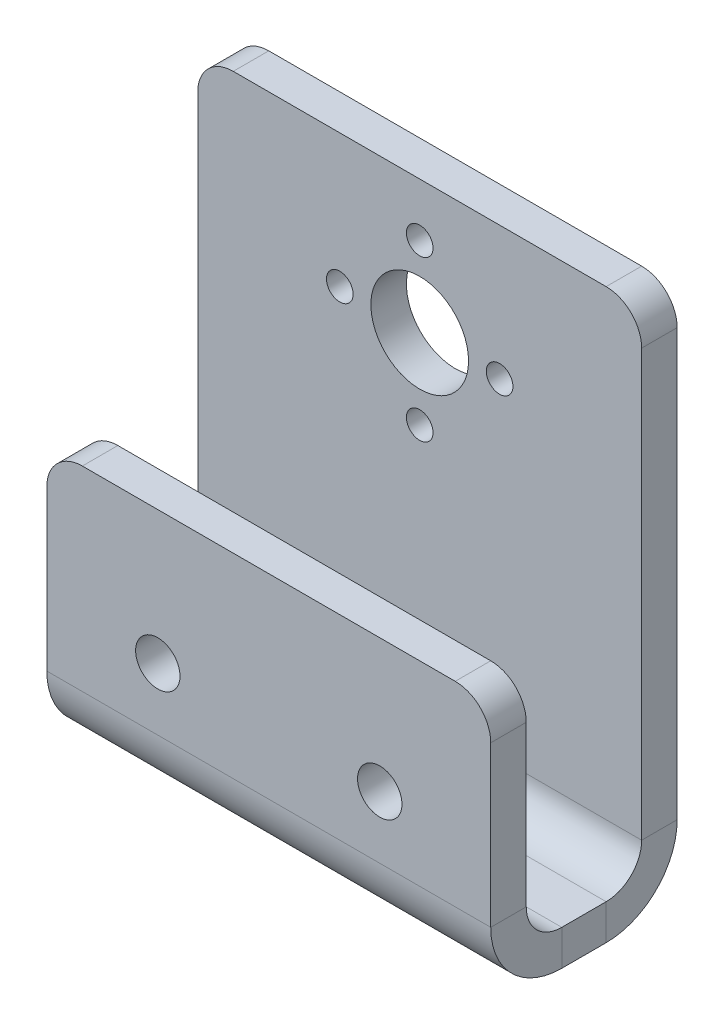
ISO-10303-21;
HEADER;
FILE_DESCRIPTION(('STEP AP214'),'2;1');
FILE_NAME('part.step','',(''),(''),'','','');
FILE_SCHEMA(('AUTOMOTIVE_DESIGN { 1 0 10303 214 1 1 1 1 }'));
ENDSEC;
DATA;
#1=APPLICATION_CONTEXT('core data for automotive mechanical design processes');
#2=APPLICATION_PROTOCOL_DEFINITION('international standard','automotive_design',2000,#1);
#3=PRODUCT_CONTEXT('',#1,'mechanical');
#4=PRODUCT('Part','Part','',(#3));
#5=PRODUCT_RELATED_PRODUCT_CATEGORY('part','',(#4));
#6=PRODUCT_DEFINITION_FORMATION('','',#4);
#7=PRODUCT_DEFINITION_CONTEXT('part definition',#1,'design');
#8=PRODUCT_DEFINITION('design','',#6,#7);
#9=PRODUCT_DEFINITION_SHAPE('','',#8);
#10=(LENGTH_UNIT() NAMED_UNIT(*) SI_UNIT(.MILLI.,.METRE.));
#11=(NAMED_UNIT(*) PLANE_ANGLE_UNIT() SI_UNIT($,.RADIAN.));
#12=(NAMED_UNIT(*) SI_UNIT($,.STERADIAN.) SOLID_ANGLE_UNIT());
#13=UNCERTAINTY_MEASURE_WITH_UNIT(LENGTH_MEASURE(1.E-05),#10,'distance_accuracy_value','');
#14=(GEOMETRIC_REPRESENTATION_CONTEXT(3) GLOBAL_UNCERTAINTY_ASSIGNED_CONTEXT((#13)) GLOBAL_UNIT_ASSIGNED_CONTEXT((#10,
#11,#12)) REPRESENTATION_CONTEXT('',''));
#15=CARTESIAN_POINT('',(0.,0.,0.));
#16=DIRECTION('',(0.,0.,1.));
#17=DIRECTION('',(1.,0.,0.));
#18=AXIS2_PLACEMENT_3D('',#15,#16,#17);
#19=CARTESIAN_POINT('',(50.,-56.,17.));
#20=DIRECTION('',(1.,0.,0.));
#21=DIRECTION('',(0.,0.,-1.));
#22=AXIS2_PLACEMENT_3D('',#19,#20,#21);
#23=PLANE('',#22);
#24=DIRECTION('',(0.,1.,0.));
#25=VECTOR('',#24,1.);
#26=CARTESIAN_POINT('',(50.,-56.,13.));
#27=LINE('',#26,#25);
#28=CARTESIAN_POINT('',(50.,-60.,13.));
#29=VERTEX_POINT('',#28);
#30=CARTESIAN_POINT('',(50.,-56.,13.));
#31=VERTEX_POINT('',#30);
#32=EDGE_CURVE('E281',#29,#31,#27,.T.);
#33=ORIENTED_EDGE('',*,*,#32,.F.);
#34=DIRECTION('',(0.,0.,1.));
#35=VECTOR('',#34,1.);
#36=CARTESIAN_POINT('',(50.,-60.,17.));
#37=LINE('',#36,#35);
#38=CARTESIAN_POINT('',(50.,-60.,7.99999999999999));
#39=VERTEX_POINT('',#38);
#40=EDGE_CURVE('E242',#29,#39,#37,.F.);
#41=ORIENTED_EDGE('',*,*,#40,.T.);
#42=DIRECTION('',(0.,1.,0.));
#43=VECTOR('',#42,1.);
#44=CARTESIAN_POINT('',(50.,-56.,7.99999999999999));
#45=LINE('',#44,#43);
#46=CARTESIAN_POINT('',(50.,-56.,7.99999999999999));
#47=VERTEX_POINT('',#46);
#48=EDGE_CURVE('E279',#39,#47,#45,.T.);
#49=ORIENTED_EDGE('',*,*,#48,.T.);
#50=DIRECTION('',(0.,0.,-1.));
#51=VECTOR('',#50,1.);
#52=CARTESIAN_POINT('',(50.,-56.,17.));
#53=LINE('',#52,#51);
#54=EDGE_CURVE('E185',#31,#47,#53,.T.);
#55=ORIENTED_EDGE('',*,*,#54,.F.);
#56=EDGE_LOOP('',(#33,#41,#49,#55));
#57=FACE_BOUND('',#56,.T.);
#58=ADVANCED_FACE('F37',(#57),#23,.T.);
#59=CARTESIAN_POINT('',(50.,-52.,7.99999999999999));
#60=DIRECTION('',(1.,0.,0.));
#61=DIRECTION('',(0.,0.,-1.));
#62=AXIS2_PLACEMENT_3D('',#59,#60,#61);
#63=PLANE('',#62);
#64=ORIENTED_EDGE('',*,*,#48,.F.);
#65=CARTESIAN_POINT('',(50.,-52.,7.99999999999999));
#66=DIRECTION('',(1.,0.,0.));
#67=DIRECTION('',(0.,0.,-1.));
#68=AXIS2_PLACEMENT_3D('',#65,#66,#67);
#69=CIRCLE('',#68,8.);
#70=CARTESIAN_POINT('',(50.,-52.,0.));
#71=VERTEX_POINT('',#70);
#72=EDGE_CURVE('E243',#39,#71,#69,.T.);
#73=ORIENTED_EDGE('',*,*,#72,.T.);
#74=DIRECTION('',(0.,0.,1.));
#75=VECTOR('',#74,1.);
#76=CARTESIAN_POINT('',(50.,-52.,3.99999999999999));
#77=LINE('',#76,#75);
#78=CARTESIAN_POINT('',(50.,-52.,3.99999999999999));
#79=VERTEX_POINT('',#78);
#80=EDGE_CURVE('E277',#71,#79,#77,.T.);
#81=ORIENTED_EDGE('',*,*,#80,.T.);
#82=CARTESIAN_POINT('',(50.,-52.,7.99999999999999));
#83=DIRECTION('',(-1.,0.,0.));
#84=DIRECTION('',(0.,0.,1.));
#85=AXIS2_PLACEMENT_3D('',#82,#83,#84);
#86=CIRCLE('',#85,4.);
#87=EDGE_CURVE('E176',#47,#79,#86,.F.);
#88=ORIENTED_EDGE('',*,*,#87,.F.);
#89=EDGE_LOOP('',(#64,#73,#81,#88));
#90=FACE_BOUND('',#89,.T.);
#91=ADVANCED_FACE('F441',(#90),#63,.T.);
#92=CARTESIAN_POINT('',(50.,-56.,3.99999999999999));
#93=DIRECTION('',(1.,0.,0.));
#94=DIRECTION('',(0.,1.,0.));
#95=AXIS2_PLACEMENT_3D('',#92,#93,#94);
#96=PLANE('',#95);
#97=DIRECTION('',(0.,-1.,0.));
#98=VECTOR('',#97,1.);
#99=CARTESIAN_POINT('',(50.,-56.,0.));
#100=LINE('',#99,#98);
#101=CARTESIAN_POINT('',(50.,-4.,0.));
#102=VERTEX_POINT('',#101);
#103=EDGE_CURVE('E247',#71,#102,#100,.F.);
#104=ORIENTED_EDGE('',*,*,#103,.T.);
#105=DIRECTION('',(0.,0.,1.));
#106=VECTOR('',#105,1.);
#107=CARTESIAN_POINT('',(50.,-4.,3.99999999999999));
#108=LINE('',#107,#106);
#109=CARTESIAN_POINT('',(50.,-4.,3.99999999999999));
#110=VERTEX_POINT('',#109);
#111=EDGE_CURVE('E11',#102,#110,#108,.T.);
#112=ORIENTED_EDGE('',*,*,#111,.T.);
#113=DIRECTION('',(0.,1.,0.));
#114=VECTOR('',#113,1.);
#115=CARTESIAN_POINT('',(50.,-56.,3.99999999999999));
#116=LINE('',#115,#114);
#117=EDGE_CURVE('E330',#79,#110,#116,.T.);
#118=ORIENTED_EDGE('',*,*,#117,.F.);
#119=ORIENTED_EDGE('',*,*,#80,.F.);
#120=EDGE_LOOP('',(#104,#112,#118,#119));
#121=FACE_BOUND('',#120,.T.);
#122=ADVANCED_FACE('F447',(#121),#96,.T.);
#123=CARTESIAN_POINT('',(50.,0.,3.99999999999999));
#124=DIRECTION('',(0.,1.,0.));
#125=DIRECTION('',(-1.,0.,0.));
#126=AXIS2_PLACEMENT_3D('',#123,#124,#125);
#127=PLANE('',#126);
#128=DIRECTION('',(1.,0.,0.));
#129=VECTOR('',#128,1.);
#130=CARTESIAN_POINT('',(50.,0.,0.));
#131=LINE('',#130,#129);
#132=CARTESIAN_POINT('',(46.,0.,0.));
#133=VERTEX_POINT('',#132);
#134=CARTESIAN_POINT('',(4.,0.,0.));
#135=VERTEX_POINT('',#134);
#136=EDGE_CURVE('E226',#133,#135,#131,.F.);
#137=ORIENTED_EDGE('',*,*,#136,.T.);
#138=DIRECTION('',(0.,0.,-1.));
#139=VECTOR('',#138,1.);
#140=CARTESIAN_POINT('',(4.,0.,3.99999999999999));
#141=LINE('',#140,#139);
#142=CARTESIAN_POINT('',(4.,0.,3.99999999999999));
#143=VERTEX_POINT('',#142);
#144=EDGE_CURVE('E305',#135,#143,#141,.F.);
#145=ORIENTED_EDGE('',*,*,#144,.T.);
#146=DIRECTION('',(-1.,0.,0.));
#147=VECTOR('',#146,1.);
#148=CARTESIAN_POINT('',(50.,0.,3.99999999999999));
#149=LINE('',#148,#147);
#150=CARTESIAN_POINT('',(46.,0.,3.99999999999999));
#151=VERTEX_POINT('',#150);
#152=EDGE_CURVE('E328',#151,#143,#149,.T.);
#153=ORIENTED_EDGE('',*,*,#152,.F.);
#154=DIRECTION('',(0.,0.,1.));
#155=VECTOR('',#154,1.);
#156=CARTESIAN_POINT('',(46.,0.,3.99999999999999));
#157=LINE('',#156,#155);
#158=EDGE_CURVE('E303',#151,#133,#157,.F.);
#159=ORIENTED_EDGE('',*,*,#158,.T.);
#160=EDGE_LOOP('',(#137,#145,#153,#159));
#161=FACE_BOUND('',#160,.T.);
#162=ADVANCED_FACE('F319',(#161),#127,.T.);
#163=CARTESIAN_POINT('',(0.,-56.,3.99999999999999));
#164=DIRECTION('',(1.,0.,0.));
#165=DIRECTION('',(0.,1.,0.));
#166=AXIS2_PLACEMENT_3D('',#163,#164,#165);
#167=PLANE('',#166);
#168=DIRECTION('',(0.,1.,0.));
#169=VECTOR('',#168,1.);
#170=CARTESIAN_POINT('',(0.,-56.,3.99999999999999));
#171=LINE('',#170,#169);
#172=CARTESIAN_POINT('',(0.,-52.,3.99999999999999));
#173=VERTEX_POINT('',#172);
#174=CARTESIAN_POINT('',(0.,-4.,3.99999999999999));
#175=VERTEX_POINT('',#174);
#176=EDGE_CURVE('E327',#173,#175,#171,.T.);
#177=ORIENTED_EDGE('',*,*,#176,.T.);
#178=DIRECTION('',(0.,0.,1.));
#179=VECTOR('',#178,1.);
#180=CARTESIAN_POINT('',(0.,-4.,3.99999999999999));
#181=LINE('',#180,#179);
#182=CARTESIAN_POINT('',(0.,-4.,0.));
#183=VERTEX_POINT('',#182);
#184=EDGE_CURVE('E60',#175,#183,#181,.F.);
#185=ORIENTED_EDGE('',*,*,#184,.T.);
#186=DIRECTION('',(0.,-1.,0.));
#187=VECTOR('',#186,1.);
#188=CARTESIAN_POINT('',(0.,-56.,0.));
#189=LINE('',#188,#187);
#190=CARTESIAN_POINT('',(0.,-52.,0.));
#191=VERTEX_POINT('',#190);
#192=EDGE_CURVE('E245',#191,#183,#189,.F.);
#193=ORIENTED_EDGE('',*,*,#192,.F.);
#194=DIRECTION('',(0.,0.,1.));
#195=VECTOR('',#194,1.);
#196=CARTESIAN_POINT('',(0.,-52.,3.99999999999999));
#197=LINE('',#196,#195);
#198=EDGE_CURVE('E165',#191,#173,#197,.T.);
#199=ORIENTED_EDGE('',*,*,#198,.T.);
#200=EDGE_LOOP('',(#177,#185,#193,#199));
#201=FACE_BOUND('',#200,.T.);
#202=ADVANCED_FACE('F329',(#201),#167,.F.);
#203=CARTESIAN_POINT('',(0.,-52.,7.99999999999999));
#204=DIRECTION('',(-1.,0.,0.));
#205=DIRECTION('',(0.,0.,1.));
#206=AXIS2_PLACEMENT_3D('',#203,#204,#205);
#207=PLANE('',#206);
#208=ORIENTED_EDGE('',*,*,#198,.F.);
#209=CARTESIAN_POINT('',(0.,-52.,7.99999999999999));
#210=DIRECTION('',(1.,0.,0.));
#211=DIRECTION('',(0.,0.,-1.));
#212=AXIS2_PLACEMENT_3D('',#209,#210,#211);
#213=CIRCLE('',#212,8.);
#214=CARTESIAN_POINT('',(0.,-60.,7.99999999999999));
#215=VERTEX_POINT('',#214);
#216=EDGE_CURVE('E160',#191,#215,#213,.F.);
#217=ORIENTED_EDGE('',*,*,#216,.T.);
#218=DIRECTION('',(0.,1.,0.));
#219=VECTOR('',#218,1.);
#220=CARTESIAN_POINT('',(0.,-56.,7.99999999999999));
#221=LINE('',#220,#219);
#222=CARTESIAN_POINT('',(0.,-56.,7.99999999999999));
#223=VERTEX_POINT('',#222);
#224=EDGE_CURVE('E154',#215,#223,#221,.T.);
#225=ORIENTED_EDGE('',*,*,#224,.T.);
#226=CARTESIAN_POINT('',(0.,-52.,7.99999999999999));
#227=DIRECTION('',(1.,0.,0.));
#228=DIRECTION('',(0.,0.,-1.));
#229=AXIS2_PLACEMENT_3D('',#226,#227,#228);
#230=CIRCLE('',#229,4.);
#231=EDGE_CURVE('E157',#173,#223,#230,.F.);
#232=ORIENTED_EDGE('',*,*,#231,.F.);
#233=EDGE_LOOP('',(#208,#217,#225,#232));
#234=FACE_BOUND('',#233,.T.);
#235=ADVANCED_FACE('F156',(#234),#207,.T.);
#236=CARTESIAN_POINT('',(0.,-56.,17.));
#237=DIRECTION('',(1.,0.,0.));
#238=DIRECTION('',(0.,0.,-1.));
#239=AXIS2_PLACEMENT_3D('',#236,#237,#238);
#240=PLANE('',#239);
#241=ORIENTED_EDGE('',*,*,#224,.F.);
#242=DIRECTION('',(0.,0.,1.));
#243=VECTOR('',#242,1.);
#244=CARTESIAN_POINT('',(0.,-60.,17.));
#245=LINE('',#244,#243);
#246=CARTESIAN_POINT('',(0.,-60.,13.));
#247=VERTEX_POINT('',#246);
#248=EDGE_CURVE('E239',#247,#215,#245,.F.);
#249=ORIENTED_EDGE('',*,*,#248,.F.);
#250=DIRECTION('',(0.,1.,0.));
#251=VECTOR('',#250,1.);
#252=CARTESIAN_POINT('',(0.,-56.,13.));
#253=LINE('',#252,#251);
#254=CARTESIAN_POINT('',(0.,-56.,13.));
#255=VERTEX_POINT('',#254);
#256=EDGE_CURVE('E166',#247,#255,#253,.T.);
#257=ORIENTED_EDGE('',*,*,#256,.T.);
#258=DIRECTION('',(0.,0.,-1.));
#259=VECTOR('',#258,1.);
#260=CARTESIAN_POINT('',(0.,-56.,17.));
#261=LINE('',#260,#259);
#262=EDGE_CURVE('E180',#255,#223,#261,.T.);
#263=ORIENTED_EDGE('',*,*,#262,.T.);
#264=EDGE_LOOP('',(#241,#249,#257,#263));
#265=FACE_BOUND('',#264,.T.);
#266=ADVANCED_FACE('F181',(#265),#240,.F.);
#267=CARTESIAN_POINT('',(0.,-52.,13.));
#268=DIRECTION('',(-1.,0.,0.));
#269=DIRECTION('',(0.,0.,1.));
#270=AXIS2_PLACEMENT_3D('',#267,#268,#269);
#271=PLANE('',#270);
#272=ORIENTED_EDGE('',*,*,#256,.F.);
#273=CARTESIAN_POINT('',(0.,-52.,13.));
#274=DIRECTION('',(1.,0.,0.));
#275=DIRECTION('',(0.,0.,-1.));
#276=AXIS2_PLACEMENT_3D('',#273,#274,#275);
#277=CIRCLE('',#276,8.);
#278=CARTESIAN_POINT('',(0.,-52.,21.));
#279=VERTEX_POINT('',#278);
#280=EDGE_CURVE('E235',#247,#279,#277,.F.);
#281=ORIENTED_EDGE('',*,*,#280,.T.);
#282=DIRECTION('',(0.,0.,-1.));
#283=VECTOR('',#282,1.);
#284=CARTESIAN_POINT('',(0.,-52.,17.));
#285=LINE('',#284,#283);
#286=CARTESIAN_POINT('',(0.,-52.,17.));
#287=VERTEX_POINT('',#286);
#288=EDGE_CURVE('E272',#279,#287,#285,.T.);
#289=ORIENTED_EDGE('',*,*,#288,.T.);
#290=CARTESIAN_POINT('',(0.,-52.,13.));
#291=DIRECTION('',(1.,0.,0.));
#292=DIRECTION('',(0.,0.,-1.));
#293=AXIS2_PLACEMENT_3D('',#290,#291,#292);
#294=CIRCLE('',#293,4.);
#295=EDGE_CURVE('E205',#255,#287,#294,.F.);
#296=ORIENTED_EDGE('',*,*,#295,.F.);
#297=EDGE_LOOP('',(#272,#281,#289,#296));
#298=FACE_BOUND('',#297,.T.);
#299=ADVANCED_FACE('F374',(#298),#271,.T.);
#300=CARTESIAN_POINT('',(0.,-30.,17.));
#301=DIRECTION('',(1.,0.,0.));
#302=DIRECTION('',(0.,-1.,0.));
#303=AXIS2_PLACEMENT_3D('',#300,#301,#302);
#304=PLANE('',#303);
#305=DIRECTION('',(0.,1.,0.));
#306=VECTOR('',#305,1.);
#307=CARTESIAN_POINT('',(0.,-30.,21.));
#308=LINE('',#307,#306);
#309=CARTESIAN_POINT('',(0.,-34.,21.));
#310=VERTEX_POINT('',#309);
#311=EDGE_CURVE('E229',#310,#279,#308,.F.);
#312=ORIENTED_EDGE('',*,*,#311,.F.);
#313=DIRECTION('',(0.,0.,1.));
#314=VECTOR('',#313,1.);
#315=CARTESIAN_POINT('',(0.,-34.,17.));
#316=LINE('',#315,#314);
#317=CARTESIAN_POINT('',(0.,-34.,17.));
#318=VERTEX_POINT('',#317);
#319=EDGE_CURVE('E300',#310,#318,#316,.F.);
#320=ORIENTED_EDGE('',*,*,#319,.T.);
#321=DIRECTION('',(0.,-1.,0.));
#322=VECTOR('',#321,1.);
#323=CARTESIAN_POINT('',(0.,-30.,17.));
#324=LINE('',#323,#322);
#325=EDGE_CURVE('E347',#318,#287,#324,.T.);
#326=ORIENTED_EDGE('',*,*,#325,.T.);
#327=ORIENTED_EDGE('',*,*,#288,.F.);
#328=EDGE_LOOP('',(#312,#320,#326,#327));
#329=FACE_BOUND('',#328,.T.);
#330=ADVANCED_FACE('F367',(#329),#304,.F.);
#331=CARTESIAN_POINT('',(50.,-30.,17.));
#332=DIRECTION('',(0.,-1.,0.));
#333=DIRECTION('',(-1.,0.,0.));
#334=AXIS2_PLACEMENT_3D('',#331,#332,#333);
#335=PLANE('',#334);
#336=DIRECTION('',(1.,0.,0.));
#337=VECTOR('',#336,1.);
#338=CARTESIAN_POINT('',(50.,-30.,21.));
#339=LINE('',#338,#337);
#340=CARTESIAN_POINT('',(46.,-30.,21.));
#341=VERTEX_POINT('',#340);
#342=CARTESIAN_POINT('',(4.,-30.,21.));
#343=VERTEX_POINT('',#342);
#344=EDGE_CURVE('E231',#341,#343,#339,.F.);
#345=ORIENTED_EDGE('',*,*,#344,.F.);
#346=DIRECTION('',(0.,0.,-1.));
#347=VECTOR('',#346,1.);
#348=CARTESIAN_POINT('',(46.,-30.,17.));
#349=LINE('',#348,#347);
#350=CARTESIAN_POINT('',(46.,-30.,17.));
#351=VERTEX_POINT('',#350);
#352=EDGE_CURVE('E287',#341,#351,#349,.T.);
#353=ORIENTED_EDGE('',*,*,#352,.T.);
#354=DIRECTION('',(-1.,0.,0.));
#355=VECTOR('',#354,1.);
#356=CARTESIAN_POINT('',(50.,-30.,17.));
#357=LINE('',#356,#355);
#358=CARTESIAN_POINT('',(4.,-30.,17.));
#359=VERTEX_POINT('',#358);
#360=EDGE_CURVE('E195',#351,#359,#357,.T.);
#361=ORIENTED_EDGE('',*,*,#360,.T.);
#362=DIRECTION('',(0.,0.,1.));
#363=VECTOR('',#362,1.);
#364=CARTESIAN_POINT('',(4.,-30.,17.));
#365=LINE('',#364,#363);
#366=EDGE_CURVE('E283',#359,#343,#365,.T.);
#367=ORIENTED_EDGE('',*,*,#366,.T.);
#368=EDGE_LOOP('',(#345,#353,#361,#367));
#369=FACE_BOUND('',#368,.T.);
#370=ADVANCED_FACE('F353',(#369),#335,.F.);
#371=CARTESIAN_POINT('',(50.,-30.,17.));
#372=DIRECTION('',(1.,0.,0.));
#373=DIRECTION('',(0.,-1.,0.));
#374=AXIS2_PLACEMENT_3D('',#371,#372,#373);
#375=PLANE('',#374);
#376=DIRECTION('',(0.,-1.,0.));
#377=VECTOR('',#376,1.);
#378=CARTESIAN_POINT('',(50.,-30.,17.));
#379=LINE('',#378,#377);
#380=CARTESIAN_POINT('',(50.,-34.,17.));
#381=VERTEX_POINT('',#380);
#382=CARTESIAN_POINT('',(50.,-52.,17.));
#383=VERTEX_POINT('',#382);
#384=EDGE_CURVE('E191',#381,#383,#379,.T.);
#385=ORIENTED_EDGE('',*,*,#384,.F.);
#386=DIRECTION('',(0.,0.,1.));
#387=VECTOR('',#386,1.);
#388=CARTESIAN_POINT('',(50.,-34.,17.));
#389=LINE('',#388,#387);
#390=CARTESIAN_POINT('',(50.,-34.,21.));
#391=VERTEX_POINT('',#390);
#392=EDGE_CURVE('E294',#381,#391,#389,.T.);
#393=ORIENTED_EDGE('',*,*,#392,.T.);
#394=DIRECTION('',(0.,1.,0.));
#395=VECTOR('',#394,1.);
#396=CARTESIAN_POINT('',(50.,-30.,21.));
#397=LINE('',#396,#395);
#398=CARTESIAN_POINT('',(50.,-52.,21.));
#399=VERTEX_POINT('',#398);
#400=EDGE_CURVE('E219',#391,#399,#397,.F.);
#401=ORIENTED_EDGE('',*,*,#400,.T.);
#402=DIRECTION('',(0.,0.,-1.));
#403=VECTOR('',#402,1.);
#404=CARTESIAN_POINT('',(50.,-52.,17.));
#405=LINE('',#404,#403);
#406=EDGE_CURVE('E204',#399,#383,#405,.T.);
#407=ORIENTED_EDGE('',*,*,#406,.T.);
#408=EDGE_LOOP('',(#385,#393,#401,#407));
#409=FACE_BOUND('',#408,.T.);
#410=ADVANCED_FACE('F390',(#409),#375,.T.);
#411=CARTESIAN_POINT('',(25.,-6.,3.99999999999999));
#412=DIRECTION('',(0.,0.,1.));
#413=DIRECTION('',(0.,-1.,0.));
#414=AXIS2_PLACEMENT_3D('',#411,#412,#413);
#415=CYLINDRICAL_SURFACE('',#414,1.5);
#416=CARTESIAN_POINT('',(25.,-6.,3.99999999999999));
#417=DIRECTION('',(0.,0.,1.));
#418=DIRECTION('',(1.,0.,0.));
#419=AXIS2_PLACEMENT_3D('',#416,#417,#418);
#420=CIRCLE('',#419,1.5);
#421=CARTESIAN_POINT('',(26.5,-6.,3.99999999999999));
#422=VERTEX_POINT('',#421);
#423=EDGE_CURVE('E398',#422,#422,#420,.T.);
#424=ORIENTED_EDGE('',*,*,#423,.T.);
#425=EDGE_LOOP('',(#424));
#426=FACE_BOUND('',#425,.T.);
#427=CARTESIAN_POINT('',(25.,-6.,0.));
#428=DIRECTION('',(0.,0.,1.));
#429=DIRECTION('',(1.,0.,0.));
#430=AXIS2_PLACEMENT_3D('',#427,#428,#429);
#431=CIRCLE('',#430,1.5);
#432=CARTESIAN_POINT('',(26.5,-6.,0.));
#433=VERTEX_POINT('',#432);
#434=EDGE_CURVE('E256',#433,#433,#431,.T.);
#435=ORIENTED_EDGE('',*,*,#434,.F.);
#436=EDGE_LOOP('',(#435));
#437=FACE_BOUND('',#436,.T.);
#438=ADVANCED_FACE('F455',(#426,#437),#415,.F.);
#439=CARTESIAN_POINT('',(16.0000000000003,-15.0000000000002,3.99999999999999));
#440=DIRECTION('',(0.,0.,1.));
#441=DIRECTION('',(0.,-1.,0.));
#442=AXIS2_PLACEMENT_3D('',#439,#440,#441);
#443=CYLINDRICAL_SURFACE('',#442,1.5);
#444=CARTESIAN_POINT('',(16.0000000000003,-15.0000000000002,3.99999999999999));
#445=DIRECTION('',(0.,0.,1.));
#446=DIRECTION('',(1.,0.,0.));
#447=AXIS2_PLACEMENT_3D('',#444,#445,#446);
#448=CIRCLE('',#447,1.5);
#449=CARTESIAN_POINT('',(17.5000000000003,-15.0000000000002,3.99999999999999));
#450=VERTEX_POINT('',#449);
#451=EDGE_CURVE('E401',#450,#450,#448,.T.);
#452=ORIENTED_EDGE('',*,*,#451,.T.);
#453=EDGE_LOOP('',(#452));
#454=FACE_BOUND('',#453,.T.);
#455=CARTESIAN_POINT('',(16.0000000000003,-15.0000000000002,0.));
#456=DIRECTION('',(0.,0.,1.));
#457=DIRECTION('',(1.,0.,0.));
#458=AXIS2_PLACEMENT_3D('',#455,#456,#457);
#459=CIRCLE('',#458,1.5);
#460=CARTESIAN_POINT('',(17.5000000000003,-15.0000000000002,0.));
#461=VERTEX_POINT('',#460);
#462=EDGE_CURVE('E261',#461,#461,#459,.T.);
#463=ORIENTED_EDGE('',*,*,#462,.F.);
#464=EDGE_LOOP('',(#463));
#465=FACE_BOUND('',#464,.T.);
#466=ADVANCED_FACE('F458',(#454,#465),#443,.F.);
#467=CARTESIAN_POINT('',(25.0000000000005,-24.,3.99999999999999));
#468=DIRECTION('',(0.,0.,1.));
#469=DIRECTION('',(0.,-1.,0.));
#470=AXIS2_PLACEMENT_3D('',#467,#468,#469);
#471=CYLINDRICAL_SURFACE('',#470,1.5);
#472=CARTESIAN_POINT('',(25.0000000000005,-24.,3.99999999999999));
#473=DIRECTION('',(0.,0.,1.));
#474=DIRECTION('',(1.,0.,0.));
#475=AXIS2_PLACEMENT_3D('',#472,#473,#474);
#476=CIRCLE('',#475,1.5);
#477=CARTESIAN_POINT('',(26.5000000000005,-24.,3.99999999999999));
#478=VERTEX_POINT('',#477);
#479=EDGE_CURVE('E406',#478,#478,#476,.T.);
#480=ORIENTED_EDGE('',*,*,#479,.T.);
#481=EDGE_LOOP('',(#480));
#482=FACE_BOUND('',#481,.T.);
#483=CARTESIAN_POINT('',(25.0000000000005,-24.,0.));
#484=DIRECTION('',(0.,0.,1.));
#485=DIRECTION('',(1.,0.,0.));
#486=AXIS2_PLACEMENT_3D('',#483,#484,#485);
#487=CIRCLE('',#486,1.5);
#488=CARTESIAN_POINT('',(26.5000000000005,-24.,0.));
#489=VERTEX_POINT('',#488);
#490=EDGE_CURVE('E264',#489,#489,#487,.T.);
#491=ORIENTED_EDGE('',*,*,#490,.F.);
#492=EDGE_LOOP('',(#491));
#493=FACE_BOUND('',#492,.T.);
#494=ADVANCED_FACE('F462',(#482,#493),#471,.F.);
#495=CARTESIAN_POINT('',(34.0000000000003,-14.9999999999998,3.99999999999999));
#496=DIRECTION('',(0.,0.,1.));
#497=DIRECTION('',(0.,-1.,0.));
#498=AXIS2_PLACEMENT_3D('',#495,#496,#497);
#499=CYLINDRICAL_SURFACE('',#498,1.5);
#500=CARTESIAN_POINT('',(34.0000000000003,-14.9999999999998,3.99999999999999));
#501=DIRECTION('',(0.,0.,1.));
#502=DIRECTION('',(1.,0.,0.));
#503=AXIS2_PLACEMENT_3D('',#500,#501,#502);
#504=CIRCLE('',#503,1.5);
#505=CARTESIAN_POINT('',(35.5000000000003,-14.9999999999998,3.99999999999999));
#506=VERTEX_POINT('',#505);
#507=EDGE_CURVE('E336',#506,#506,#504,.T.);
#508=ORIENTED_EDGE('',*,*,#507,.T.);
#509=EDGE_LOOP('',(#508));
#510=FACE_BOUND('',#509,.T.);
#511=CARTESIAN_POINT('',(34.0000000000003,-14.9999999999998,0.));
#512=DIRECTION('',(0.,0.,1.));
#513=DIRECTION('',(1.,0.,0.));
#514=AXIS2_PLACEMENT_3D('',#511,#512,#513);
#515=CIRCLE('',#514,1.5);
#516=CARTESIAN_POINT('',(35.5000000000003,-14.9999999999998,0.));
#517=VERTEX_POINT('',#516);
#518=EDGE_CURVE('E267',#517,#517,#515,.T.);
#519=ORIENTED_EDGE('',*,*,#518,.F.);
#520=EDGE_LOOP('',(#519));
#521=FACE_BOUND('',#520,.T.);
#522=ADVANCED_FACE('F411',(#510,#521),#499,.F.);
#523=CARTESIAN_POINT('',(25.,-15.,3.99999999999999));
#524=DIRECTION('',(0.,0.,1.));
#525=DIRECTION('',(0.,-1.,0.));
#526=AXIS2_PLACEMENT_3D('',#523,#524,#525);
#527=CYLINDRICAL_SURFACE('',#526,5.5);
#528=CARTESIAN_POINT('',(25.,-15.,3.99999999999999));
#529=DIRECTION('',(0.,0.,1.));
#530=DIRECTION('',(1.,0.,0.));
#531=AXIS2_PLACEMENT_3D('',#528,#529,#530);
#532=CIRCLE('',#531,5.5);
#533=CARTESIAN_POINT('',(30.5,-15.,3.99999999999999));
#534=VERTEX_POINT('',#533);
#535=EDGE_CURVE('E331',#534,#534,#532,.T.);
#536=ORIENTED_EDGE('',*,*,#535,.T.);
#537=EDGE_LOOP('',(#536));
#538=FACE_BOUND('',#537,.T.);
#539=CARTESIAN_POINT('',(25.,-15.,0.));
#540=DIRECTION('',(0.,0.,1.));
#541=DIRECTION('',(1.,0.,0.));
#542=AXIS2_PLACEMENT_3D('',#539,#540,#541);
#543=CIRCLE('',#542,5.5);
#544=CARTESIAN_POINT('',(30.5,-15.,0.));
#545=VERTEX_POINT('',#544);
#546=EDGE_CURVE('E248',#545,#545,#543,.T.);
#547=ORIENTED_EDGE('',*,*,#546,.F.);
#548=EDGE_LOOP('',(#547));
#549=FACE_BOUND('',#548,.T.);
#550=ADVANCED_FACE('F420',(#538,#549),#527,.F.);
#551=CARTESIAN_POINT('',(12.5,-45.,17.));
#552=DIRECTION('',(0.,0.,-1.));
#553=DIRECTION('',(0.,1.,0.));
#554=AXIS2_PLACEMENT_3D('',#551,#552,#553);
#555=CYLINDRICAL_SURFACE('',#554,2.5);
#556=CARTESIAN_POINT('',(12.5,-45.,17.));
#557=DIRECTION('',(0.,0.,-1.));
#558=DIRECTION('',(0.,1.,0.));
#559=AXIS2_PLACEMENT_3D('',#556,#557,#558);
#560=CIRCLE('',#559,2.5);
#561=CARTESIAN_POINT('',(12.5,-42.5,17.));
#562=VERTEX_POINT('',#561);
#563=EDGE_CURVE('E341',#562,#562,#560,.T.);
#564=ORIENTED_EDGE('',*,*,#563,.T.);
#565=EDGE_LOOP('',(#564));
#566=FACE_BOUND('',#565,.T.);
#567=CARTESIAN_POINT('',(12.5,-45.,21.));
#568=DIRECTION('',(0.,0.,-1.));
#569=DIRECTION('',(0.,1.,0.));
#570=AXIS2_PLACEMENT_3D('',#567,#568,#569);
#571=CIRCLE('',#570,2.5);
#572=CARTESIAN_POINT('',(12.5,-42.5,21.));
#573=VERTEX_POINT('',#572);
#574=EDGE_CURVE('E222',#573,#573,#571,.T.);
#575=ORIENTED_EDGE('',*,*,#574,.F.);
#576=EDGE_LOOP('',(#575));
#577=FACE_BOUND('',#576,.T.);
#578=ADVANCED_FACE('F423',(#566,#577),#555,.F.);
#579=CARTESIAN_POINT('',(37.5,-45.,17.));
#580=DIRECTION('',(0.,0.,-1.));
#581=DIRECTION('',(0.,1.,0.));
#582=AXIS2_PLACEMENT_3D('',#579,#580,#581);
#583=CYLINDRICAL_SURFACE('',#582,2.5);
#584=CARTESIAN_POINT('',(37.5,-45.,17.));
#585=DIRECTION('',(0.,0.,-1.));
#586=DIRECTION('',(0.,1.,0.));
#587=AXIS2_PLACEMENT_3D('',#584,#585,#586);
#588=CIRCLE('',#587,2.5);
#589=CARTESIAN_POINT('',(37.5,-42.5,17.));
#590=VERTEX_POINT('',#589);
#591=EDGE_CURVE('E344',#590,#590,#588,.T.);
#592=ORIENTED_EDGE('',*,*,#591,.T.);
#593=EDGE_LOOP('',(#592));
#594=FACE_BOUND('',#593,.T.);
#595=CARTESIAN_POINT('',(37.5,-45.,21.));
#596=DIRECTION('',(0.,0.,-1.));
#597=DIRECTION('',(0.,1.,0.));
#598=AXIS2_PLACEMENT_3D('',#595,#596,#597);
#599=CIRCLE('',#598,2.5);
#600=CARTESIAN_POINT('',(37.5,-42.5,21.));
#601=VERTEX_POINT('',#600);
#602=EDGE_CURVE('E225',#601,#601,#599,.T.);
#603=ORIENTED_EDGE('',*,*,#602,.F.);
#604=EDGE_LOOP('',(#603));
#605=FACE_BOUND('',#604,.T.);
#606=ADVANCED_FACE('F454',(#594,#605),#583,.F.);
#607=CARTESIAN_POINT('',(50.,-52.,13.));
#608=DIRECTION('',(1.,0.,0.));
#609=DIRECTION('',(0.,0.,-1.));
#610=AXIS2_PLACEMENT_3D('',#607,#608,#609);
#611=PLANE('',#610);
#612=CARTESIAN_POINT('',(50.,-52.,13.));
#613=DIRECTION('',(1.,0.,0.));
#614=DIRECTION('',(0.,0.,-1.));
#615=AXIS2_PLACEMENT_3D('',#612,#613,#614);
#616=CIRCLE('',#615,8.);
#617=EDGE_CURVE('E238',#399,#29,#616,.T.);
#618=ORIENTED_EDGE('',*,*,#617,.T.);
#619=ORIENTED_EDGE('',*,*,#32,.T.);
#620=CARTESIAN_POINT('',(50.,-52.,13.));
#621=DIRECTION('',(-1.,0.,0.));
#622=DIRECTION('',(0.,0.,1.));
#623=AXIS2_PLACEMENT_3D('',#620,#621,#622);
#624=CIRCLE('',#623,4.);
#625=EDGE_CURVE('E177',#383,#31,#624,.F.);
#626=ORIENTED_EDGE('',*,*,#625,.F.);
#627=ORIENTED_EDGE('',*,*,#406,.F.);
#628=EDGE_LOOP('',(#618,#619,#626,#627));
#629=FACE_BOUND('',#628,.T.);
#630=ADVANCED_FACE('F385',(#629),#611,.T.);
#631=CARTESIAN_POINT('',(50.,-30.,17.));
#632=DIRECTION('',(0.,0.,-1.));
#633=DIRECTION('',(0.,1.,0.));
#634=AXIS2_PLACEMENT_3D('',#631,#632,#633);
#635=PLANE('',#634);
#636=ORIENTED_EDGE('',*,*,#563,.F.);
#637=EDGE_LOOP('',(#636));
#638=FACE_BOUND('',#637,.T.);
#639=ORIENTED_EDGE('',*,*,#591,.F.);
#640=EDGE_LOOP('',(#639));
#641=FACE_BOUND('',#640,.T.);
#642=ORIENTED_EDGE('',*,*,#360,.F.);
#643=CARTESIAN_POINT('',(46.,-34.,17.));
#644=DIRECTION('',(0.,0.,-1.));
#645=DIRECTION('',(0.,1.,0.));
#646=AXIS2_PLACEMENT_3D('',#643,#644,#645);
#647=CIRCLE('',#646,4.);
#648=EDGE_CURVE('E292',#351,#381,#647,.T.);
#649=ORIENTED_EDGE('',*,*,#648,.T.);
#650=ORIENTED_EDGE('',*,*,#384,.T.);
#651=DIRECTION('',(-1.,0.,0.));
#652=VECTOR('',#651,1.);
#653=CARTESIAN_POINT('',(0.,-52.,17.));
#654=LINE('',#653,#652);
#655=EDGE_CURVE('E193',#383,#287,#654,.T.);
#656=ORIENTED_EDGE('',*,*,#655,.T.);
#657=ORIENTED_EDGE('',*,*,#325,.F.);
#658=CARTESIAN_POINT('',(4.,-34.,17.));
#659=DIRECTION('',(0.,0.,-1.));
#660=DIRECTION('',(0.,1.,0.));
#661=AXIS2_PLACEMENT_3D('',#658,#659,#660);
#662=CIRCLE('',#661,4.);
#663=EDGE_CURVE('E290',#318,#359,#662,.T.);
#664=ORIENTED_EDGE('',*,*,#663,.T.);
#665=EDGE_LOOP('',(#642,#649,#650,#656,#657,#664));
#666=FACE_BOUND('',#665,.T.);
#667=ADVANCED_FACE('F395',(#638,#641,#666),#635,.T.);
#668=CARTESIAN_POINT('',(50.,-56.,3.99999999999999));
#669=DIRECTION('',(0.,0.,1.));
#670=DIRECTION('',(0.,-1.,0.));
#671=AXIS2_PLACEMENT_3D('',#668,#669,#670);
#672=PLANE('',#671);
#673=ORIENTED_EDGE('',*,*,#423,.F.);
#674=EDGE_LOOP('',(#673));
#675=FACE_BOUND('',#674,.T.);
#676=ORIENTED_EDGE('',*,*,#451,.F.);
#677=EDGE_LOOP('',(#676));
#678=FACE_BOUND('',#677,.T.);
#679=ORIENTED_EDGE('',*,*,#479,.F.);
#680=EDGE_LOOP('',(#679));
#681=FACE_BOUND('',#680,.T.);
#682=ORIENTED_EDGE('',*,*,#507,.F.);
#683=EDGE_LOOP('',(#682));
#684=FACE_BOUND('',#683,.T.);
#685=ORIENTED_EDGE('',*,*,#535,.F.);
#686=EDGE_LOOP('',(#685));
#687=FACE_BOUND('',#686,.T.);
#688=ORIENTED_EDGE('',*,*,#152,.T.);
#689=CARTESIAN_POINT('',(4.,-4.,3.99999999999999));
#690=DIRECTION('',(0.,0.,1.));
#691=DIRECTION('',(0.,-1.,0.));
#692=AXIS2_PLACEMENT_3D('',#689,#690,#691);
#693=CIRCLE('',#692,4.);
#694=EDGE_CURVE('E310',#143,#175,#693,.T.);
#695=ORIENTED_EDGE('',*,*,#694,.T.);
#696=ORIENTED_EDGE('',*,*,#176,.F.);
#697=DIRECTION('',(-1.,0.,0.));
#698=VECTOR('',#697,1.);
#699=CARTESIAN_POINT('',(50.,-52.,3.99999999999999));
#700=LINE('',#699,#698);
#701=EDGE_CURVE('E175',#173,#79,#700,.F.);
#702=ORIENTED_EDGE('',*,*,#701,.T.);
#703=ORIENTED_EDGE('',*,*,#117,.T.);
#704=CARTESIAN_POINT('',(46.,-4.,3.99999999999999));
#705=DIRECTION('',(0.,0.,1.));
#706=DIRECTION('',(0.,-1.,0.));
#707=AXIS2_PLACEMENT_3D('',#704,#705,#706);
#708=CIRCLE('',#707,4.);
#709=EDGE_CURVE('E308',#110,#151,#708,.T.);
#710=ORIENTED_EDGE('',*,*,#709,.T.);
#711=EDGE_LOOP('',(#688,#695,#696,#702,#703,#710));
#712=FACE_BOUND('',#711,.T.);
#713=ADVANCED_FACE('F326',(#675,#678,#681,#684,#687,#712),#672,.T.);
#714=CARTESIAN_POINT('',(50.,-56.,17.));
#715=DIRECTION('',(0.,1.,0.));
#716=DIRECTION('',(0.,0.,1.));
#717=AXIS2_PLACEMENT_3D('',#714,#715,#716);
#718=PLANE('',#717);
#719=ORIENTED_EDGE('',*,*,#262,.F.);
#720=DIRECTION('',(-1.,0.,0.));
#721=VECTOR('',#720,1.);
#722=CARTESIAN_POINT('',(50.,-56.,13.));
#723=LINE('',#722,#721);
#724=EDGE_CURVE('E202',#255,#31,#723,.F.);
#725=ORIENTED_EDGE('',*,*,#724,.T.);
#726=ORIENTED_EDGE('',*,*,#54,.T.);
#727=DIRECTION('',(-1.,0.,0.));
#728=VECTOR('',#727,1.);
#729=CARTESIAN_POINT('',(0.,-56.,7.99999999999999));
#730=LINE('',#729,#728);
#731=EDGE_CURVE('E173',#47,#223,#730,.T.);
#732=ORIENTED_EDGE('',*,*,#731,.T.);
#733=EDGE_LOOP('',(#719,#725,#726,#732));
#734=FACE_BOUND('',#733,.T.);
#735=ADVANCED_FACE('F188',(#734),#718,.T.);
#736=CARTESIAN_POINT('',(50.,-52.,7.99999999999999));
#737=DIRECTION('',(1.,0.,0.));
#738=DIRECTION('',(0.,0.,-1.));
#739=AXIS2_PLACEMENT_3D('',#736,#737,#738);
#740=CYLINDRICAL_SURFACE('',#739,4.);
#741=ORIENTED_EDGE('',*,*,#87,.T.);
#742=ORIENTED_EDGE('',*,*,#701,.F.);
#743=ORIENTED_EDGE('',*,*,#231,.T.);
#744=ORIENTED_EDGE('',*,*,#731,.F.);
#745=EDGE_LOOP('',(#741,#742,#743,#744));
#746=FACE_BOUND('',#745,.T.);
#747=ADVANCED_FACE('F171',(#746),#740,.F.);
#748=CARTESIAN_POINT('',(50.,-52.,13.));
#749=DIRECTION('',(1.,0.,0.));
#750=DIRECTION('',(0.,0.,-1.));
#751=AXIS2_PLACEMENT_3D('',#748,#749,#750);
#752=CYLINDRICAL_SURFACE('',#751,4.);
#753=ORIENTED_EDGE('',*,*,#625,.T.);
#754=ORIENTED_EDGE('',*,*,#724,.F.);
#755=ORIENTED_EDGE('',*,*,#295,.T.);
#756=ORIENTED_EDGE('',*,*,#655,.F.);
#757=EDGE_LOOP('',(#753,#754,#755,#756));
#758=FACE_BOUND('',#757,.T.);
#759=ADVANCED_FACE('F397',(#758),#752,.F.);
#760=CARTESIAN_POINT('',(50.,-30.,21.));
#761=DIRECTION('',(0.,0.,-1.));
#762=DIRECTION('',(0.,1.,0.));
#763=AXIS2_PLACEMENT_3D('',#760,#761,#762);
#764=PLANE('',#763);
#765=ORIENTED_EDGE('',*,*,#574,.T.);
#766=EDGE_LOOP('',(#765));
#767=FACE_BOUND('',#766,.T.);
#768=ORIENTED_EDGE('',*,*,#602,.T.);
#769=EDGE_LOOP('',(#768));
#770=FACE_BOUND('',#769,.T.);
#771=ORIENTED_EDGE('',*,*,#400,.F.);
#772=CARTESIAN_POINT('',(46.,-34.,21.));
#773=DIRECTION('',(0.,0.,-1.));
#774=DIRECTION('',(0.,1.,0.));
#775=AXIS2_PLACEMENT_3D('',#772,#773,#774);
#776=CIRCLE('',#775,4.);
#777=EDGE_CURVE('E298',#391,#341,#776,.F.);
#778=ORIENTED_EDGE('',*,*,#777,.T.);
#779=ORIENTED_EDGE('',*,*,#344,.T.);
#780=CARTESIAN_POINT('',(4.,-34.,21.));
#781=DIRECTION('',(0.,0.,-1.));
#782=DIRECTION('',(0.,1.,0.));
#783=AXIS2_PLACEMENT_3D('',#780,#781,#782);
#784=CIRCLE('',#783,4.);
#785=EDGE_CURVE('E296',#343,#310,#784,.F.);
#786=ORIENTED_EDGE('',*,*,#785,.T.);
#787=ORIENTED_EDGE('',*,*,#311,.T.);
#788=DIRECTION('',(1.,0.,0.));
#789=VECTOR('',#788,1.);
#790=CARTESIAN_POINT('',(50.,-52.,21.));
#791=LINE('',#790,#789);
#792=EDGE_CURVE('E211',#399,#279,#791,.F.);
#793=ORIENTED_EDGE('',*,*,#792,.F.);
#794=EDGE_LOOP('',(#771,#778,#779,#786,#787,#793));
#795=FACE_BOUND('',#794,.T.);
#796=ADVANCED_FACE('F363',(#767,#770,#795),#764,.F.);
#797=CARTESIAN_POINT('',(50.,-56.,0.));
#798=DIRECTION('',(0.,0.,1.));
#799=DIRECTION('',(0.,-1.,0.));
#800=AXIS2_PLACEMENT_3D('',#797,#798,#799);
#801=PLANE('',#800);
#802=ORIENTED_EDGE('',*,*,#434,.T.);
#803=EDGE_LOOP('',(#802));
#804=FACE_BOUND('',#803,.T.);
#805=ORIENTED_EDGE('',*,*,#462,.T.);
#806=EDGE_LOOP('',(#805));
#807=FACE_BOUND('',#806,.T.);
#808=ORIENTED_EDGE('',*,*,#490,.T.);
#809=EDGE_LOOP('',(#808));
#810=FACE_BOUND('',#809,.T.);
#811=ORIENTED_EDGE('',*,*,#518,.T.);
#812=EDGE_LOOP('',(#811));
#813=FACE_BOUND('',#812,.T.);
#814=ORIENTED_EDGE('',*,*,#546,.T.);
#815=EDGE_LOOP('',(#814));
#816=FACE_BOUND('',#815,.T.);
#817=ORIENTED_EDGE('',*,*,#192,.T.);
#818=CARTESIAN_POINT('',(4.,-4.,0.));
#819=DIRECTION('',(0.,0.,1.));
#820=DIRECTION('',(0.,-1.,0.));
#821=AXIS2_PLACEMENT_3D('',#818,#819,#820);
#822=CIRCLE('',#821,4.);
#823=EDGE_CURVE('E45',#183,#135,#822,.F.);
#824=ORIENTED_EDGE('',*,*,#823,.T.);
#825=ORIENTED_EDGE('',*,*,#136,.F.);
#826=CARTESIAN_POINT('',(46.,-4.,0.));
#827=DIRECTION('',(0.,0.,1.));
#828=DIRECTION('',(0.,-1.,0.));
#829=AXIS2_PLACEMENT_3D('',#826,#827,#828);
#830=CIRCLE('',#829,4.);
#831=EDGE_CURVE('E52',#133,#102,#830,.F.);
#832=ORIENTED_EDGE('',*,*,#831,.T.);
#833=ORIENTED_EDGE('',*,*,#103,.F.);
#834=DIRECTION('',(1.,0.,0.));
#835=VECTOR('',#834,1.);
#836=CARTESIAN_POINT('',(50.,-52.,0.));
#837=LINE('',#836,#835);
#838=EDGE_CURVE('E214',#191,#71,#837,.T.);
#839=ORIENTED_EDGE('',*,*,#838,.F.);
#840=EDGE_LOOP('',(#817,#824,#825,#832,#833,#839));
#841=FACE_BOUND('',#840,.T.);
#842=ADVANCED_FACE('F314',(#804,#807,#810,#813,#816,#841),#801,.F.);
#843=CARTESIAN_POINT('',(50.,-60.,17.));
#844=DIRECTION('',(0.,1.,0.));
#845=DIRECTION('',(0.,0.,1.));
#846=AXIS2_PLACEMENT_3D('',#843,#844,#845);
#847=PLANE('',#846);
#848=ORIENTED_EDGE('',*,*,#248,.T.);
#849=DIRECTION('',(1.,0.,0.));
#850=VECTOR('',#849,1.);
#851=CARTESIAN_POINT('',(50.,-60.,7.99999999999999));
#852=LINE('',#851,#850);
#853=EDGE_CURVE('E217',#39,#215,#852,.F.);
#854=ORIENTED_EDGE('',*,*,#853,.F.);
#855=ORIENTED_EDGE('',*,*,#40,.F.);
#856=DIRECTION('',(1.,0.,0.));
#857=VECTOR('',#856,1.);
#858=CARTESIAN_POINT('',(50.,-60.,13.));
#859=LINE('',#858,#857);
#860=EDGE_CURVE('E208',#247,#29,#859,.T.);
#861=ORIENTED_EDGE('',*,*,#860,.F.);
#862=EDGE_LOOP('',(#848,#854,#855,#861));
#863=FACE_BOUND('',#862,.T.);
#864=ADVANCED_FACE('F379',(#863),#847,.F.);
#865=CARTESIAN_POINT('',(50.,-52.,7.99999999999999));
#866=DIRECTION('',(1.,0.,0.));
#867=DIRECTION('',(0.,0.,-1.));
#868=AXIS2_PLACEMENT_3D('',#865,#866,#867);
#869=CYLINDRICAL_SURFACE('',#868,8.);
#870=ORIENTED_EDGE('',*,*,#72,.F.);
#871=ORIENTED_EDGE('',*,*,#853,.T.);
#872=ORIENTED_EDGE('',*,*,#216,.F.);
#873=ORIENTED_EDGE('',*,*,#838,.T.);
#874=EDGE_LOOP('',(#870,#871,#872,#873));
#875=FACE_BOUND('',#874,.T.);
#876=ADVANCED_FACE('F435',(#875),#869,.T.);
#877=CARTESIAN_POINT('',(50.,-52.,13.));
#878=DIRECTION('',(1.,0.,0.));
#879=DIRECTION('',(0.,0.,-1.));
#880=AXIS2_PLACEMENT_3D('',#877,#878,#879);
#881=CYLINDRICAL_SURFACE('',#880,8.);
#882=ORIENTED_EDGE('',*,*,#617,.F.);
#883=ORIENTED_EDGE('',*,*,#792,.T.);
#884=ORIENTED_EDGE('',*,*,#280,.F.);
#885=ORIENTED_EDGE('',*,*,#860,.T.);
#886=EDGE_LOOP('',(#882,#883,#884,#885));
#887=FACE_BOUND('',#886,.T.);
#888=ADVANCED_FACE('F373',(#887),#881,.T.);
#889=CARTESIAN_POINT('',(46.,-34.,17.));
#890=DIRECTION('',(0.,0.,1.));
#891=DIRECTION('',(0.,-1.,0.));
#892=AXIS2_PLACEMENT_3D('',#889,#890,#891);
#893=CYLINDRICAL_SURFACE('',#892,4.);
#894=ORIENTED_EDGE('',*,*,#777,.F.);
#895=ORIENTED_EDGE('',*,*,#392,.F.);
#896=ORIENTED_EDGE('',*,*,#648,.F.);
#897=ORIENTED_EDGE('',*,*,#352,.F.);
#898=EDGE_LOOP('',(#894,#895,#896,#897));
#899=FACE_BOUND('',#898,.T.);
#900=ADVANCED_FACE('F394',(#899),#893,.T.);
#901=CARTESIAN_POINT('',(4.,-34.,17.));
#902=DIRECTION('',(0.,0.,-1.));
#903=DIRECTION('',(0.,1.,0.));
#904=AXIS2_PLACEMENT_3D('',#901,#902,#903);
#905=CYLINDRICAL_SURFACE('',#904,4.);
#906=ORIENTED_EDGE('',*,*,#785,.F.);
#907=ORIENTED_EDGE('',*,*,#366,.F.);
#908=ORIENTED_EDGE('',*,*,#663,.F.);
#909=ORIENTED_EDGE('',*,*,#319,.F.);
#910=EDGE_LOOP('',(#906,#907,#908,#909));
#911=FACE_BOUND('',#910,.T.);
#912=ADVANCED_FACE('F358',(#911),#905,.T.);
#913=CARTESIAN_POINT('',(4.,-4.,3.99999999999999));
#914=DIRECTION('',(0.,0.,-1.));
#915=DIRECTION('',(0.,1.,0.));
#916=AXIS2_PLACEMENT_3D('',#913,#914,#915);
#917=CYLINDRICAL_SURFACE('',#916,4.);
#918=ORIENTED_EDGE('',*,*,#823,.F.);
#919=ORIENTED_EDGE('',*,*,#184,.F.);
#920=ORIENTED_EDGE('',*,*,#694,.F.);
#921=ORIENTED_EDGE('',*,*,#144,.F.);
#922=EDGE_LOOP('',(#918,#919,#920,#921));
#923=FACE_BOUND('',#922,.T.);
#924=ADVANCED_FACE('F323',(#923),#917,.T.);
#925=CARTESIAN_POINT('',(46.,-4.,3.99999999999999));
#926=DIRECTION('',(0.,0.,1.));
#927=DIRECTION('',(0.,-1.,0.));
#928=AXIS2_PLACEMENT_3D('',#925,#926,#927);
#929=CYLINDRICAL_SURFACE('',#928,4.);
#930=ORIENTED_EDGE('',*,*,#831,.F.);
#931=ORIENTED_EDGE('',*,*,#158,.F.);
#932=ORIENTED_EDGE('',*,*,#709,.F.);
#933=ORIENTED_EDGE('',*,*,#111,.F.);
#934=EDGE_LOOP('',(#930,#931,#932,#933));
#935=FACE_BOUND('',#934,.T.);
#936=ADVANCED_FACE('F39',(#935),#929,.T.);
#937=CLOSED_SHELL('',(#58,#91,#122,#162,#202,#235,#266,#299,#330,#370,#410,#438,#466,#494,#522,
#550,#578,#606,#630,#667,#713,#735,#747,#759,#796,#842,#864,#876,#888,#900,#912,#924,#936));
#938=MANIFOLD_SOLID_BREP('B2',#937);
#939=ADVANCED_BREP_SHAPE_REPRESENTATION('',(#18,#938),#14);
#940=SHAPE_DEFINITION_REPRESENTATION(#9,#939);
ENDSEC;
END-ISO-10303-21;
